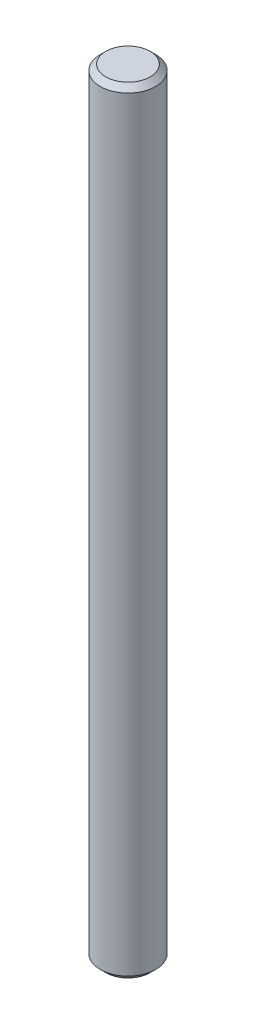
ISO-10303-21;
HEADER;
FILE_DESCRIPTION(('STEP AP214'),'2;1');
FILE_NAME('part.step','',(''),(''),'','','');
FILE_SCHEMA(('AUTOMOTIVE_DESIGN { 1 0 10303 214 1 1 1 1 }'));
ENDSEC;
DATA;
#1=APPLICATION_CONTEXT('core data for automotive mechanical design processes');
#2=APPLICATION_PROTOCOL_DEFINITION('international standard','automotive_design',2000,#1);
#3=PRODUCT_CONTEXT('',#1,'mechanical');
#4=PRODUCT('Part','Part','',(#3));
#5=PRODUCT_RELATED_PRODUCT_CATEGORY('part','',(#4));
#6=PRODUCT_DEFINITION_FORMATION('','',#4);
#7=PRODUCT_DEFINITION_CONTEXT('part definition',#1,'design');
#8=PRODUCT_DEFINITION('design','',#6,#7);
#9=PRODUCT_DEFINITION_SHAPE('','',#8);
#10=(LENGTH_UNIT() NAMED_UNIT(*) SI_UNIT(.MILLI.,.METRE.));
#11=(NAMED_UNIT(*) PLANE_ANGLE_UNIT() SI_UNIT($,.RADIAN.));
#12=(NAMED_UNIT(*) SI_UNIT($,.STERADIAN.) SOLID_ANGLE_UNIT());
#13=UNCERTAINTY_MEASURE_WITH_UNIT(LENGTH_MEASURE(1.E-05),#10,'distance_accuracy_value','');
#14=(GEOMETRIC_REPRESENTATION_CONTEXT(3) GLOBAL_UNCERTAINTY_ASSIGNED_CONTEXT((#13)) GLOBAL_UNIT_ASSIGNED_CONTEXT((#10,
#11,#12)) REPRESENTATION_CONTEXT('',''));
#15=CARTESIAN_POINT('',(0.,0.,0.));
#16=DIRECTION('',(0.,0.,1.));
#17=DIRECTION('',(1.,0.,0.));
#18=AXIS2_PLACEMENT_3D('',#15,#16,#17);
#19=CARTESIAN_POINT('',(0.,70.,0.));
#20=DIRECTION('',(0.,-1.,0.));
#21=DIRECTION('',(0.,0.,-1.));
#22=AXIS2_PLACEMENT_3D('',#19,#20,#21);
#23=CYLINDRICAL_SURFACE('',#22,2.5);
#24=CARTESIAN_POINT('',(0.,0.500000000000014,0.));
#25=DIRECTION('',(0.,1.,0.));
#26=DIRECTION('',(0.,0.,1.));
#27=AXIS2_PLACEMENT_3D('',#24,#25,#26);
#28=CIRCLE('',#27,2.5);
#29=CARTESIAN_POINT('',(0.,0.500000000000014,2.5));
#30=VERTEX_POINT('',#29);
#31=EDGE_CURVE('E46',#30,#30,#28,.T.);
#32=ORIENTED_EDGE('',*,*,#31,.T.);
#33=EDGE_LOOP('',(#32));
#34=FACE_BOUND('',#33,.T.);
#35=CARTESIAN_POINT('',(0.,69.5,0.));
#36=DIRECTION('',(0.,1.,0.));
#37=DIRECTION('',(0.,0.,1.));
#38=AXIS2_PLACEMENT_3D('',#35,#36,#37);
#39=CIRCLE('',#38,2.5);
#40=CARTESIAN_POINT('',(0.,69.5,2.5));
#41=VERTEX_POINT('',#40);
#42=EDGE_CURVE('E50',#41,#41,#39,.F.);
#43=ORIENTED_EDGE('',*,*,#42,.T.);
#44=EDGE_LOOP('',(#43));
#45=FACE_BOUND('',#44,.T.);
#46=ADVANCED_FACE('F34',(#34,#45),#23,.T.);
#47=CARTESIAN_POINT('',(0.,70.,0.));
#48=DIRECTION('',(0.,1.,0.));
#49=DIRECTION('',(0.,0.,1.));
#50=AXIS2_PLACEMENT_3D('',#47,#48,#49);
#51=PLANE('',#50);
#52=CARTESIAN_POINT('',(0.,70.,0.));
#53=DIRECTION('',(0.,1.,0.));
#54=DIRECTION('',(0.,0.,1.));
#55=AXIS2_PLACEMENT_3D('',#52,#53,#54);
#56=CIRCLE('',#55,2.);
#57=CARTESIAN_POINT('',(0.,70.,2.));
#58=VERTEX_POINT('',#57);
#59=EDGE_CURVE('E10',#58,#58,#56,.T.);
#60=ORIENTED_EDGE('',*,*,#59,.T.);
#61=EDGE_LOOP('',(#60));
#62=FACE_BOUND('',#61,.T.);
#63=ADVANCED_FACE('F66',(#62),#51,.T.);
#64=CARTESIAN_POINT('',(0.,0.,0.));
#65=DIRECTION('',(0.,1.,0.));
#66=DIRECTION('',(0.,0.,1.));
#67=AXIS2_PLACEMENT_3D('',#64,#65,#66);
#68=PLANE('',#67);
#69=CARTESIAN_POINT('',(0.,0.,0.));
#70=DIRECTION('',(0.,1.,0.));
#71=DIRECTION('',(0.,0.,1.));
#72=AXIS2_PLACEMENT_3D('',#69,#70,#71);
#73=CIRCLE('',#72,1.99999999999999);
#74=CARTESIAN_POINT('',(0.,0.,1.99999999999999));
#75=VERTEX_POINT('',#74);
#76=EDGE_CURVE('E42',#75,#75,#73,.F.);
#77=ORIENTED_EDGE('',*,*,#76,.T.);
#78=EDGE_LOOP('',(#77));
#79=FACE_BOUND('',#78,.T.);
#80=ADVANCED_FACE('F63',(#79),#68,.F.);
#81=CARTESIAN_POINT('',(0.,0.500000000000014,0.));
#82=DIRECTION('',(0.,1.,0.));
#83=DIRECTION('',(0.,0.,1.));
#84=AXIS2_PLACEMENT_3D('',#81,#82,#83);
#85=CONICAL_SURFACE('',#84,2.5,0.785398163397446);
#86=ORIENTED_EDGE('',*,*,#76,.F.);
#87=EDGE_LOOP('',(#86));
#88=FACE_BOUND('',#87,.T.);
#89=ORIENTED_EDGE('',*,*,#31,.F.);
#90=EDGE_LOOP('',(#89));
#91=FACE_BOUND('',#90,.T.);
#92=ADVANCED_FACE('F59',(#88,#91),#85,.T.);
#93=CARTESIAN_POINT('',(0.,70.,0.));
#94=DIRECTION('',(0.,-1.,0.));
#95=DIRECTION('',(0.,0.,-1.));
#96=AXIS2_PLACEMENT_3D('',#93,#94,#95);
#97=CONICAL_SURFACE('',#96,2.,0.785398163397446);
#98=ORIENTED_EDGE('',*,*,#42,.F.);
#99=EDGE_LOOP('',(#98));
#100=FACE_BOUND('',#99,.T.);
#101=ORIENTED_EDGE('',*,*,#59,.F.);
#102=EDGE_LOOP('',(#101));
#103=FACE_BOUND('',#102,.T.);
#104=ADVANCED_FACE('F37',(#100,#103),#97,.T.);
#105=CLOSED_SHELL('',(#46,#63,#80,#92,#104));
#106=MANIFOLD_SOLID_BREP('B2',#105);
#107=ADVANCED_BREP_SHAPE_REPRESENTATION('',(#18,#106),#14);
#108=SHAPE_DEFINITION_REPRESENTATION(#9,#107);
ENDSEC;
END-ISO-10303-21;
